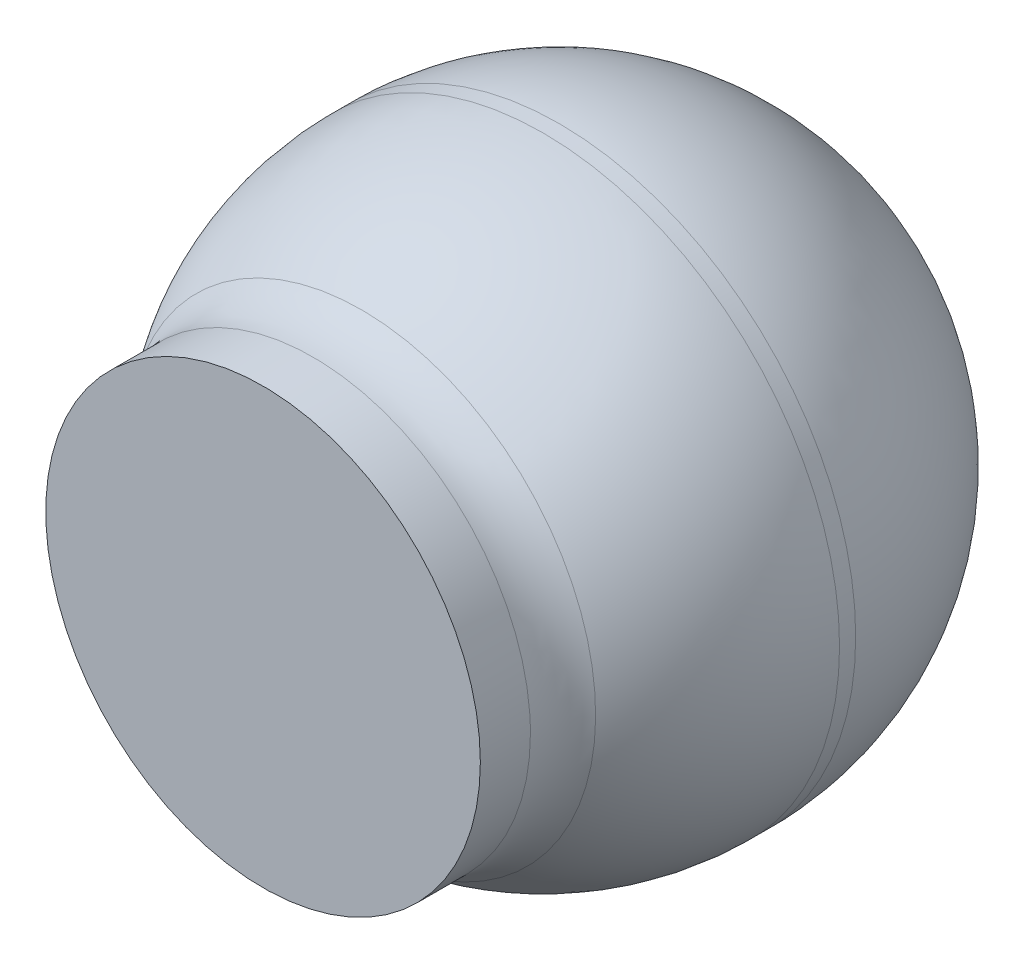
ISO-10303-21;
HEADER;
FILE_DESCRIPTION(('STEP AP214'),'2;1');
FILE_NAME('part.step','',(''),(''),'','','');
FILE_SCHEMA(('AUTOMOTIVE_DESIGN { 1 0 10303 214 1 1 1 1 }'));
ENDSEC;
DATA;
#1=APPLICATION_CONTEXT('core data for automotive mechanical design processes');
#2=APPLICATION_PROTOCOL_DEFINITION('international standard','automotive_design',2000,#1);
#3=PRODUCT_CONTEXT('',#1,'mechanical');
#4=PRODUCT('Part','Part','',(#3));
#5=PRODUCT_RELATED_PRODUCT_CATEGORY('part','',(#4));
#6=PRODUCT_DEFINITION_FORMATION('','',#4);
#7=PRODUCT_DEFINITION_CONTEXT('part definition',#1,'design');
#8=PRODUCT_DEFINITION('design','',#6,#7);
#9=PRODUCT_DEFINITION_SHAPE('','',#8);
#10=(LENGTH_UNIT() NAMED_UNIT(*) SI_UNIT(.MILLI.,.METRE.));
#11=(NAMED_UNIT(*) PLANE_ANGLE_UNIT() SI_UNIT($,.RADIAN.));
#12=(NAMED_UNIT(*) SI_UNIT($,.STERADIAN.) SOLID_ANGLE_UNIT());
#13=UNCERTAINTY_MEASURE_WITH_UNIT(LENGTH_MEASURE(1.E-05),#10,'distance_accuracy_value','');
#14=(GEOMETRIC_REPRESENTATION_CONTEXT(3) GLOBAL_UNCERTAINTY_ASSIGNED_CONTEXT((#13)) GLOBAL_UNIT_ASSIGNED_CONTEXT((#10,
#11,#12)) REPRESENTATION_CONTEXT('',''));
#15=CARTESIAN_POINT('',(0.,0.,0.));
#16=DIRECTION('',(0.,0.,1.));
#17=DIRECTION('',(1.,0.,0.));
#18=AXIS2_PLACEMENT_3D('',#15,#16,#17);
#19=CARTESIAN_POINT('',(0.707080077731,-10.40134929145,10.006534503384));
#20=DIRECTION('',(0.,0.,-1.));
#21=DIRECTION('',(-1.,0.,0.));
#22=AXIS2_PLACEMENT_3D('',#19,#20,#21);
#23=PLANE('',#22);
#24=CARTESIAN_POINT('',(0.707080077731,-10.40134929145,10.006534503384));
#25=DIRECTION('',(0.,0.,1.));
#26=DIRECTION('',(1.,0.,0.));
#27=AXIS2_PLACEMENT_3D('',#24,#25,#26);
#28=CIRCLE('',#27,0.275);
#29=CARTESIAN_POINT('',(0.982080077731,-10.40134929145,10.006534503384));
#30=VERTEX_POINT('',#29);
#31=EDGE_CURVE('E20',#30,#30,#28,.F.);
#32=ORIENTED_EDGE('',*,*,#31,.F.);
#33=EDGE_LOOP('',(#32));
#34=FACE_BOUND('',#33,.T.);
#35=ADVANCED_FACE('F17',(#34),#23,.F.);
#36=CARTESIAN_POINT('',(0.707080077731,-10.40134929145,9.906534503384));
#37=DIRECTION('',(0.,0.,1.));
#38=DIRECTION('',(1.,0.,0.));
#39=AXIS2_PLACEMENT_3D('',#36,#37,#38);
#40=CYLINDRICAL_SURFACE('',#39,0.275);
#41=CARTESIAN_POINT('',(0.707080077731,-10.40134929145,9.943180457728));
#42=DIRECTION('',(0.,0.,-1.));
#43=DIRECTION('',(0.996700902337582,0.081162252799247,0.));
#44=AXIS2_PLACEMENT_3D('',#41,#42,#43);
#45=CIRCLE('',#44,0.275);
#46=CARTESIAN_POINT('',(0.981172825873835,-10.3790296719302,9.943180457728));
#47=VERTEX_POINT('',#46);
#48=EDGE_CURVE('E66',#47,#47,#45,.F.);
#49=ORIENTED_EDGE('',*,*,#48,.T.);
#50=EDGE_LOOP('',(#49));
#51=FACE_BOUND('',#50,.T.);
#52=ORIENTED_EDGE('',*,*,#31,.T.);
#53=EDGE_LOOP('',(#52));
#54=FACE_BOUND('',#53,.T.);
#55=ADVANCED_FACE('F62',(#51,#54),#40,.T.);
#56=CARTESIAN_POINT('',(0.707080077731,-10.40134929145,9.943180457728));
#57=DIRECTION('',(0.,0.,-1.));
#58=DIRECTION('',(0.996700902337583,0.0811622527992449,0.));
#59=AXIS2_PLACEMENT_3D('',#56,#57,#58);
#60=TOROIDAL_SURFACE('',#59,0.375,0.1);
#61=ORIENTED_EDGE('',*,*,#48,.F.);
#62=EDGE_LOOP('',(#61));
#63=FACE_BOUND('',#62,.T.);
#64=CARTESIAN_POINT('',(0.707080077731001,-10.40134929145,9.881744931236));
#65=DIRECTION('',(0.,0.,-1.));
#66=DIRECTION('',(-0.99670090233869,-0.0811622527856411,0.));
#67=AXIS2_PLACEMENT_3D('',#64,#65,#66);
#68=CIRCLE('',#67,0.29609704641234);
#69=CARTESIAN_POINT('',(0.411959884392,-10.42538119478,9.881744931236));
#70=VERTEX_POINT('',#69);
#71=EDGE_CURVE('E39',#70,#70,#68,.T.);
#72=ORIENTED_EDGE('',*,*,#71,.F.);
#73=EDGE_LOOP('',(#72));
#74=FACE_BOUND('',#73,.T.);
#75=ADVANCED_FACE('F57',(#63,#74),#60,.F.);
#76=CARTESIAN_POINT('',(0.333317239355,-10.43178513625,9.651976062157));
#77=CARTESIAN_POINT('',(0.333317239355,-10.43178513625,9.701461392103));
#78=CARTESIAN_POINT('',(0.341473782652,-10.43112094157,9.750947004335));
#79=CARTESIAN_POINT('',(0.357792914651,-10.42979205995,9.798626332798));
#80=CARTESIAN_POINT('',(0.381658609162,-10.42784865493,9.842699544317));
#81=CARTESIAN_POINT('',(0.411959884392,-10.42538119478,9.881744931236));
#82=(BOUNDED_CURVE() B_SPLINE_CURVE(5,(#76,#77,#78,#79,#80,#81),.UNSPECIFIED.,.F.,
.F.) B_SPLINE_CURVE_WITH_KNOTS((6,6),(0.,0.661568582165),
.UNSPECIFIED.) CURVE() GEOMETRIC_REPRESENTATION_ITEM() RATIONAL_B_SPLINE_CURVE((1.,1.,1.,1.,1.,1.)) REPRESENTATION_ITEM(''));
#83=CARTESIAN_POINT('',(0.707080077731,-10.40134929145,9.651976062157));
#84=DIRECTION('',(0.,0.,-1.));
#85=AXIS1_PLACEMENT('',#83,#84);
#86=SURFACE_OF_REVOLUTION('',#82,#85);
#87=CARTESIAN_POINT('',(0.707080077731001,-10.40134929145,9.651976062157));
#88=DIRECTION('',(0.,0.,1.));
#89=DIRECTION('',(1.,0.,0.));
#90=AXIS2_PLACEMENT_3D('',#87,#88,#89);
#91=CIRCLE('',#90,0.375);
#92=CARTESIAN_POINT('',(1.082080077731,-10.40134929145,9.651976062157));
#93=VERTEX_POINT('',#92);
#94=EDGE_CURVE('E36',#93,#93,#91,.F.);
#95=ORIENTED_EDGE('',*,*,#94,.F.);
#96=EDGE_LOOP('',(#95));
#97=FACE_BOUND('',#96,.T.);
#98=ORIENTED_EDGE('',*,*,#71,.T.);
#99=EDGE_LOOP('',(#98));
#100=FACE_BOUND('',#99,.T.);
#101=ADVANCED_FACE('F53',(#97,#100),#86,.F.);
#102=CARTESIAN_POINT('',(0.707080077731,-10.40134929145,9.256534503384));
#103=DIRECTION('',(0.,0.,1.));
#104=DIRECTION('',(1.,0.,0.));
#105=AXIS2_PLACEMENT_3D('',#102,#103,#104);
#106=CYLINDRICAL_SURFACE('',#105,0.375);
#107=CARTESIAN_POINT('',(0.707080077731,-10.40134929145,9.631534503384));
#108=DIRECTION('',(0.,0.,-1.));
#109=DIRECTION('',(0.0811622527992362,-0.996700902337583,0.));
#110=AXIS2_PLACEMENT_3D('',#107,#108,#109);
#111=CIRCLE('',#110,0.375);
#112=CARTESIAN_POINT('',(0.737515922530714,-10.7751121298266,9.631534503384));
#113=VERTEX_POINT('',#112);
#114=CARTESIAN_POINT('',(0.676644232931287,-10.0275864530734,9.631534503384));
#115=VERTEX_POINT('',#114);
#116=EDGE_CURVE('E11',#113,#115,#111,.T.);
#117=ORIENTED_EDGE('',*,*,#116,.F.);
#118=CARTESIAN_POINT('',(0.707080077731,-10.40134929145,9.631534503384));
#119=DIRECTION('',(3.33436315446763E-12,2.72100352061447E-13,1.));
#120=DIRECTION('',(0.0811622527992359,-0.996700902337583,0.));
#121=AXIS2_PLACEMENT_3D('',#118,#119,#120);
#122=CIRCLE('',#121,0.375);
#123=EDGE_CURVE('E25',#115,#113,#122,.F.);
#124=ORIENTED_EDGE('',*,*,#123,.F.);
#125=EDGE_LOOP('',(#117,#124));
#126=FACE_BOUND('',#125,.T.);
#127=ORIENTED_EDGE('',*,*,#94,.T.);
#128=EDGE_LOOP('',(#127));
#129=FACE_BOUND('',#128,.T.);
#130=ADVANCED_FACE('F34',(#126,#129),#106,.T.);
#131=CARTESIAN_POINT('',(0.707080077731,-10.40134929145,9.631534503384));
#132=DIRECTION('',(0.0811622527992361,-0.996700902337583,0.));
#133=DIRECTION('',(-0.996700902337583,-0.0811622527992361,0.));
#134=AXIS2_PLACEMENT_3D('',#131,#132,#133);
#135=SPHERICAL_SURFACE('',#134,0.375);
#136=ORIENTED_EDGE('',*,*,#123,.T.);
#137=ORIENTED_EDGE('',*,*,#116,.T.);
#138=EDGE_LOOP('',(#136,#137));
#139=FACE_BOUND('',#138,.T.);
#140=ADVANCED_FACE('F32',(#139),#135,.T.);
#141=CLOSED_SHELL('',(#35,#55,#75,#101,#130,#140));
#142=MANIFOLD_SOLID_BREP('B1',#141);
#143=ADVANCED_BREP_SHAPE_REPRESENTATION('',(#18,#142),#14);
#144=SHAPE_DEFINITION_REPRESENTATION(#9,#143);
ENDSEC;
END-ISO-10303-21;
